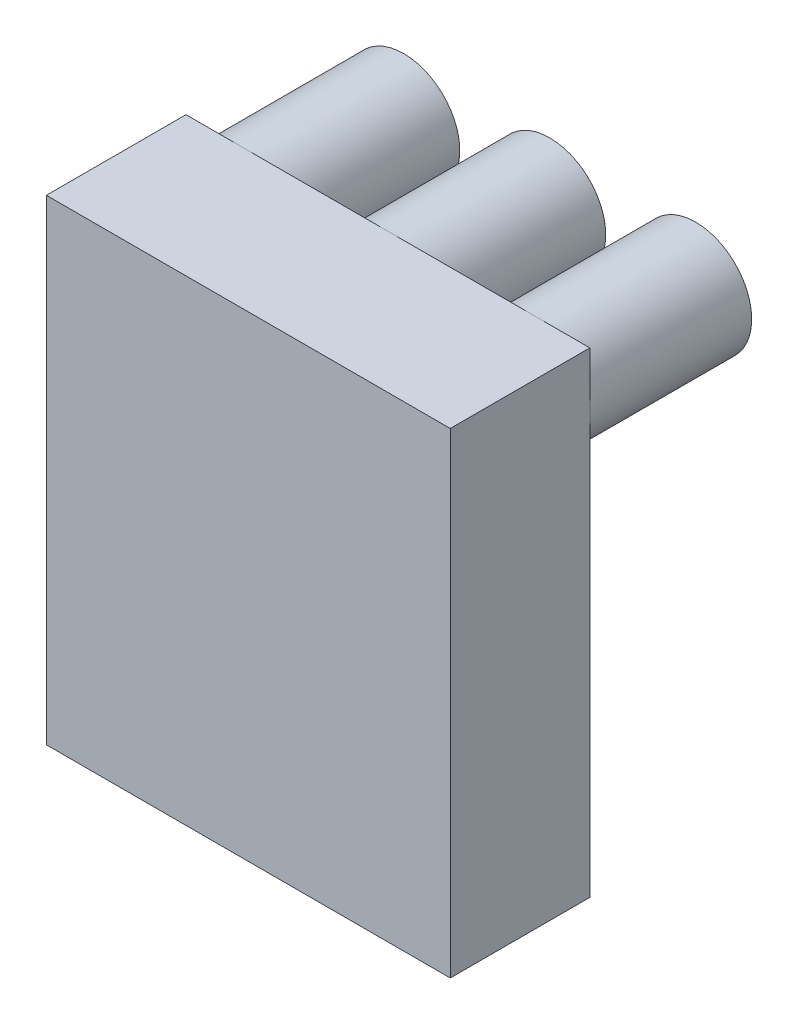
ISO-10303-21;
HEADER;
FILE_DESCRIPTION(('STEP AP214'),'2;1');
FILE_NAME('part.step','',(''),(''),'','','');
FILE_SCHEMA(('AUTOMOTIVE_DESIGN { 1 0 10303 214 1 1 1 1 }'));
ENDSEC;
DATA;
#1=APPLICATION_CONTEXT('core data for automotive mechanical design processes');
#2=APPLICATION_PROTOCOL_DEFINITION('international standard','automotive_design',2000,#1);
#3=PRODUCT_CONTEXT('',#1,'mechanical');
#4=PRODUCT('Part','Part','',(#3));
#5=PRODUCT_RELATED_PRODUCT_CATEGORY('part','',(#4));
#6=PRODUCT_DEFINITION_FORMATION('','',#4);
#7=PRODUCT_DEFINITION_CONTEXT('part definition',#1,'design');
#8=PRODUCT_DEFINITION('design','',#6,#7);
#9=PRODUCT_DEFINITION_SHAPE('','',#8);
#10=(LENGTH_UNIT() NAMED_UNIT(*) SI_UNIT(.MILLI.,.METRE.));
#11=(NAMED_UNIT(*) PLANE_ANGLE_UNIT() SI_UNIT($,.RADIAN.));
#12=(NAMED_UNIT(*) SI_UNIT($,.STERADIAN.) SOLID_ANGLE_UNIT());
#13=UNCERTAINTY_MEASURE_WITH_UNIT(LENGTH_MEASURE(1.E-05),#10,'distance_accuracy_value','');
#14=(GEOMETRIC_REPRESENTATION_CONTEXT(3) GLOBAL_UNCERTAINTY_ASSIGNED_CONTEXT((#13)) GLOBAL_UNIT_ASSIGNED_CONTEXT((#10,
#11,#12)) REPRESENTATION_CONTEXT('',''));
#15=CARTESIAN_POINT('',(0.,0.,0.));
#16=DIRECTION('',(0.,0.,1.));
#17=DIRECTION('',(1.,0.,0.));
#18=AXIS2_PLACEMENT_3D('',#15,#16,#17);
#19=CARTESIAN_POINT('',(40.41775,-84.04225,32.385));
#20=DIRECTION('',(0.,0.,-1.));
#21=DIRECTION('',(-1.,0.,0.));
#22=AXIS2_PLACEMENT_3D('',#19,#20,#21);
#23=PLANE('',#22);
#24=DIRECTION('',(-1.,0.,0.));
#25=VECTOR('',#24,1.);
#26=CARTESIAN_POINT('',(40.41775,11.20775,32.385));
#27=LINE('',#26,#25);
#28=CARTESIAN_POINT('',(-29.21,11.20775,32.385));
#29=VERTEX_POINT('',#28);
#30=CARTESIAN_POINT('',(-40.41775,11.20775,32.385));
#31=VERTEX_POINT('',#30);
#32=EDGE_CURVE('E239',#29,#31,#27,.T.);
#33=ORIENTED_EDGE('',*,*,#32,.F.);
#34=CARTESIAN_POINT('',(-29.21,0.,32.385));
#35=DIRECTION('',(0.,0.,-1.));
#36=DIRECTION('',(-1.,0.,0.));
#37=AXIS2_PLACEMENT_3D('',#34,#35,#36);
#38=CIRCLE('',#37,11.20775);
#39=CARTESIAN_POINT('',(-40.41775,0.,32.385));
#40=VERTEX_POINT('',#39);
#41=EDGE_CURVE('E199',#29,#40,#38,.F.);
#42=ORIENTED_EDGE('',*,*,#41,.T.);
#43=DIRECTION('',(0.,1.,0.));
#44=VECTOR('',#43,1.);
#45=CARTESIAN_POINT('',(-40.41775,-84.04225,32.385));
#46=LINE('',#45,#44);
#47=EDGE_CURVE('E272',#40,#31,#46,.T.);
#48=ORIENTED_EDGE('',*,*,#47,.T.);
#49=EDGE_LOOP('',(#33,#42,#48));
#50=FACE_BOUND('',#49,.T.);
#51=ADVANCED_FACE('F33',(#50),#23,.T.);
#52=DIRECTION('',(0.,1.,0.));
#53=VECTOR('',#52,1.);
#54=CARTESIAN_POINT('',(-27.4955,-84.04225,32.385));
#55=LINE('',#54,#53);
#56=CARTESIAN_POINT('',(-27.4955,-12.1045363030744,32.385));
#57=VERTEX_POINT('',#56);
#58=CARTESIAN_POINT('',(-27.4955,-11.0758363030744,32.385));
#59=VERTEX_POINT('',#58);
#60=EDGE_CURVE('E172',#57,#59,#55,.T.);
#61=ORIENTED_EDGE('',*,*,#60,.T.);
#62=EDGE_CURVE('E202',#59,#29,#38,.F.);
#63=ORIENTED_EDGE('',*,*,#62,.T.);
#64=CARTESIAN_POINT('',(0.,11.20775,32.385));
#65=VERTEX_POINT('',#64);
#66=EDGE_CURVE('E245',#65,#29,#27,.T.);
#67=ORIENTED_EDGE('',*,*,#66,.F.);
#68=CARTESIAN_POINT('',(0.,0.,32.385));
#69=DIRECTION('',(0.,0.,-1.));
#70=DIRECTION('',(-1.,0.,0.));
#71=AXIS2_PLACEMENT_3D('',#68,#69,#70);
#72=CIRCLE('',#71,11.20775);
#73=CARTESIAN_POINT('',(-1.7145,-11.0758363030744,32.385));
#74=VERTEX_POINT('',#73);
#75=EDGE_CURVE('E281',#74,#65,#72,.T.);
#76=ORIENTED_EDGE('',*,*,#75,.F.);
#77=DIRECTION('',(0.,1.,0.));
#78=VECTOR('',#77,1.);
#79=CARTESIAN_POINT('',(-1.71449999999999,0.,32.385));
#80=LINE('',#79,#78);
#81=CARTESIAN_POINT('',(-1.7145,-12.1045363030744,32.385));
#82=VERTEX_POINT('',#81);
#83=EDGE_CURVE('E278',#82,#74,#80,.T.);
#84=ORIENTED_EDGE('',*,*,#83,.F.);
#85=DIRECTION('',(-1.,0.,0.));
#86=VECTOR('',#85,1.);
#87=CARTESIAN_POINT('',(0.,-12.1045363030744,32.385));
#88=LINE('',#87,#86);
#89=CARTESIAN_POINT('',(1.7145,-12.1045363030744,32.385));
#90=VERTEX_POINT('',#89);
#91=EDGE_CURVE('E266',#90,#82,#88,.T.);
#92=ORIENTED_EDGE('',*,*,#91,.F.);
#93=DIRECTION('',(0.,-1.,0.));
#94=VECTOR('',#93,1.);
#95=CARTESIAN_POINT('',(1.71449999999999,0.,32.385));
#96=LINE('',#95,#94);
#97=CARTESIAN_POINT('',(1.7145,-11.0758363030744,32.385));
#98=VERTEX_POINT('',#97);
#99=EDGE_CURVE('E11',#98,#90,#96,.T.);
#100=ORIENTED_EDGE('',*,*,#99,.F.);
#101=EDGE_CURVE('E284',#65,#98,#72,.T.);
#102=ORIENTED_EDGE('',*,*,#101,.F.);
#103=CARTESIAN_POINT('',(29.21,11.20775,32.385));
#104=VERTEX_POINT('',#103);
#105=EDGE_CURVE('E244',#104,#65,#27,.T.);
#106=ORIENTED_EDGE('',*,*,#105,.F.);
#107=CARTESIAN_POINT('',(29.21,0.,32.385));
#108=DIRECTION('',(0.,0.,-1.));
#109=DIRECTION('',(-1.,0.,0.));
#110=AXIS2_PLACEMENT_3D('',#107,#108,#109);
#111=CIRCLE('',#110,11.20775);
#112=CARTESIAN_POINT('',(27.4955,-11.0758363030744,32.385));
#113=VERTEX_POINT('',#112);
#114=EDGE_CURVE('E234',#104,#113,#111,.F.);
#115=ORIENTED_EDGE('',*,*,#114,.T.);
#116=DIRECTION('',(0.,-1.,0.));
#117=VECTOR('',#116,1.);
#118=CARTESIAN_POINT('',(27.4955,-84.04225,32.385));
#119=LINE('',#118,#117);
#120=CARTESIAN_POINT('',(27.4955,-12.1045363030744,32.385));
#121=VERTEX_POINT('',#120);
#122=EDGE_CURVE('E228',#113,#121,#119,.T.);
#123=ORIENTED_EDGE('',*,*,#122,.T.);
#124=DIRECTION('',(1.,0.,0.));
#125=VECTOR('',#124,1.);
#126=CARTESIAN_POINT('',(40.41775,-12.1045363030744,32.385));
#127=LINE('',#126,#125);
#128=CARTESIAN_POINT('',(30.9245,-12.1045363030744,32.385));
#129=VERTEX_POINT('',#128);
#130=EDGE_CURVE('E225',#121,#129,#127,.T.);
#131=ORIENTED_EDGE('',*,*,#130,.T.);
#132=DIRECTION('',(0.,1.,0.));
#133=VECTOR('',#132,1.);
#134=CARTESIAN_POINT('',(30.9245,-84.04225,32.385));
#135=LINE('',#134,#133);
#136=CARTESIAN_POINT('',(30.9245,-11.0758363030744,32.385));
#137=VERTEX_POINT('',#136);
#138=EDGE_CURVE('E222',#129,#137,#135,.T.);
#139=ORIENTED_EDGE('',*,*,#138,.T.);
#140=CARTESIAN_POINT('',(40.41775,0.,32.385));
#141=VERTEX_POINT('',#140);
#142=EDGE_CURVE('E231',#137,#141,#111,.F.);
#143=ORIENTED_EDGE('',*,*,#142,.T.);
#144=DIRECTION('',(0.,1.,0.));
#145=VECTOR('',#144,1.);
#146=CARTESIAN_POINT('',(40.41775,-84.04225,32.385));
#147=LINE('',#146,#145);
#148=CARTESIAN_POINT('',(40.41775,-84.04225,32.385));
#149=VERTEX_POINT('',#148);
#150=EDGE_CURVE('E273',#149,#141,#147,.T.);
#151=ORIENTED_EDGE('',*,*,#150,.F.);
#152=DIRECTION('',(-1.,0.,0.));
#153=VECTOR('',#152,1.);
#154=CARTESIAN_POINT('',(40.41775,-84.04225,32.385));
#155=LINE('',#154,#153);
#156=CARTESIAN_POINT('',(-40.41775,-84.04225,32.385));
#157=VERTEX_POINT('',#156);
#158=EDGE_CURVE('E253',#149,#157,#155,.T.);
#159=ORIENTED_EDGE('',*,*,#158,.T.);
#160=EDGE_CURVE('E269',#157,#40,#46,.T.);
#161=ORIENTED_EDGE('',*,*,#160,.T.);
#162=CARTESIAN_POINT('',(-30.9245,-11.0758363030744,32.385));
#163=VERTEX_POINT('',#162);
#164=EDGE_CURVE('E203',#40,#163,#38,.F.);
#165=ORIENTED_EDGE('',*,*,#164,.T.);
#166=DIRECTION('',(0.,-1.,0.));
#167=VECTOR('',#166,1.);
#168=CARTESIAN_POINT('',(-30.9245,-84.04225,32.385));
#169=LINE('',#168,#167);
#170=CARTESIAN_POINT('',(-30.9245,-12.1045363030744,32.385));
#171=VERTEX_POINT('',#170);
#172=EDGE_CURVE('E168',#163,#171,#169,.T.);
#173=ORIENTED_EDGE('',*,*,#172,.T.);
#174=DIRECTION('',(1.,0.,0.));
#175=VECTOR('',#174,1.);
#176=CARTESIAN_POINT('',(40.41775,-12.1045363030744,32.385));
#177=LINE('',#176,#175);
#178=EDGE_CURVE('E195',#171,#57,#177,.T.);
#179=ORIENTED_EDGE('',*,*,#178,.T.);
#180=EDGE_LOOP('',(#61,#63,#67,#76,#84,#92,#100,#102,#106,#115,#123,#131,#139,#143,#151,#159,
#161,#165,#173,#179));
#181=FACE_BOUND('',#180,.T.);
#182=ADVANCED_FACE('F322',(#181),#23,.T.);
#183=CARTESIAN_POINT('',(40.41775,11.20775,32.385));
#184=VERTEX_POINT('',#183);
#185=EDGE_CURVE('E262',#141,#184,#147,.T.);
#186=ORIENTED_EDGE('',*,*,#185,.F.);
#187=EDGE_CURVE('E235',#141,#104,#111,.F.);
#188=ORIENTED_EDGE('',*,*,#187,.T.);
#189=EDGE_CURVE('E240',#184,#104,#27,.T.);
#190=ORIENTED_EDGE('',*,*,#189,.F.);
#191=EDGE_LOOP('',(#186,#188,#190));
#192=FACE_BOUND('',#191,.T.);
#193=ADVANCED_FACE('F348',(#192),#23,.T.);
#194=CARTESIAN_POINT('',(0.,0.,60.325));
#195=DIRECTION('',(0.,0.,-1.));
#196=DIRECTION('',(-1.,0.,0.));
#197=AXIS2_PLACEMENT_3D('',#194,#195,#196);
#198=CYLINDRICAL_SURFACE('',#197,11.20775);
#199=ORIENTED_EDGE('',*,*,#75,.T.);
#200=ORIENTED_EDGE('',*,*,#101,.T.);
#201=DIRECTION('',(0.,0.,-1.));
#202=VECTOR('',#201,1.);
#203=CARTESIAN_POINT('',(1.7145,-11.0758363030744,60.325));
#204=LINE('',#203,#202);
#205=CARTESIAN_POINT('',(1.7145,-11.0758363030744,0.));
#206=VERTEX_POINT('',#205);
#207=EDGE_CURVE('E297',#98,#206,#204,.T.);
#208=ORIENTED_EDGE('',*,*,#207,.T.);
#209=CARTESIAN_POINT('',(0.,0.,0.));
#210=DIRECTION('',(0.,0.,1.));
#211=DIRECTION('',(1.,0.,0.));
#212=AXIS2_PLACEMENT_3D('',#209,#210,#211);
#213=CIRCLE('',#212,11.20775);
#214=CARTESIAN_POINT('',(-1.7145,-11.0758363030744,0.));
#215=VERTEX_POINT('',#214);
#216=EDGE_CURVE('E285',#206,#215,#213,.T.);
#217=ORIENTED_EDGE('',*,*,#216,.T.);
#218=DIRECTION('',(0.,0.,-1.));
#219=VECTOR('',#218,1.);
#220=CARTESIAN_POINT('',(-1.7145,-11.0758363030744,60.325));
#221=LINE('',#220,#219);
#222=EDGE_CURVE('E41',#74,#215,#221,.T.);
#223=ORIENTED_EDGE('',*,*,#222,.F.);
#224=EDGE_LOOP('',(#199,#200,#208,#217,#223));
#225=FACE_BOUND('',#224,.T.);
#226=ADVANCED_FACE('F35',(#225),#198,.T.);
#227=CARTESIAN_POINT('',(-1.71449999999999,0.,60.325));
#228=DIRECTION('',(1.,0.,0.));
#229=DIRECTION('',(0.,1.,0.));
#230=AXIS2_PLACEMENT_3D('',#227,#228,#229);
#231=PLANE('',#230);
#232=DIRECTION('',(0.,0.,-1.));
#233=VECTOR('',#232,1.);
#234=CARTESIAN_POINT('',(-1.7145,-12.1045363030744,60.325));
#235=LINE('',#234,#233);
#236=CARTESIAN_POINT('',(-1.7145,-12.1045363030744,0.));
#237=VERTEX_POINT('',#236);
#238=EDGE_CURVE('E301',#82,#237,#235,.T.);
#239=ORIENTED_EDGE('',*,*,#238,.F.);
#240=ORIENTED_EDGE('',*,*,#83,.T.);
#241=ORIENTED_EDGE('',*,*,#222,.T.);
#242=DIRECTION('',(0.,-1.,0.));
#243=VECTOR('',#242,1.);
#244=CARTESIAN_POINT('',(-1.71449999999999,0.,0.));
#245=LINE('',#244,#243);
#246=EDGE_CURVE('E288',#215,#237,#245,.T.);
#247=ORIENTED_EDGE('',*,*,#246,.T.);
#248=EDGE_LOOP('',(#239,#240,#241,#247));
#249=FACE_BOUND('',#248,.T.);
#250=ADVANCED_FACE('F306',(#249),#231,.F.);
#251=CARTESIAN_POINT('',(0.,-12.1045363030744,60.325));
#252=DIRECTION('',(0.,1.,0.));
#253=DIRECTION('',(0.,0.,1.));
#254=AXIS2_PLACEMENT_3D('',#251,#252,#253);
#255=PLANE('',#254);
#256=DIRECTION('',(0.,0.,-1.));
#257=VECTOR('',#256,1.);
#258=CARTESIAN_POINT('',(1.7145,-12.1045363030744,60.325));
#259=LINE('',#258,#257);
#260=CARTESIAN_POINT('',(1.7145,-12.1045363030744,0.));
#261=VERTEX_POINT('',#260);
#262=EDGE_CURVE('E299',#90,#261,#259,.T.);
#263=ORIENTED_EDGE('',*,*,#262,.F.);
#264=ORIENTED_EDGE('',*,*,#91,.T.);
#265=ORIENTED_EDGE('',*,*,#238,.T.);
#266=DIRECTION('',(1.,0.,0.));
#267=VECTOR('',#266,1.);
#268=CARTESIAN_POINT('',(0.,-12.1045363030744,0.));
#269=LINE('',#268,#267);
#270=EDGE_CURVE('E291',#237,#261,#269,.T.);
#271=ORIENTED_EDGE('',*,*,#270,.T.);
#272=EDGE_LOOP('',(#263,#264,#265,#271));
#273=FACE_BOUND('',#272,.T.);
#274=ADVANCED_FACE('F320',(#273),#255,.F.);
#275=CARTESIAN_POINT('',(1.71449999999999,0.,60.325));
#276=DIRECTION('',(-1.,0.,0.));
#277=DIRECTION('',(0.,-1.,0.));
#278=AXIS2_PLACEMENT_3D('',#275,#276,#277);
#279=PLANE('',#278);
#280=ORIENTED_EDGE('',*,*,#207,.F.);
#281=ORIENTED_EDGE('',*,*,#99,.T.);
#282=ORIENTED_EDGE('',*,*,#262,.T.);
#283=DIRECTION('',(0.,1.,0.));
#284=VECTOR('',#283,1.);
#285=CARTESIAN_POINT('',(1.71449999999999,0.,0.));
#286=LINE('',#285,#284);
#287=EDGE_CURVE('E294',#261,#206,#286,.T.);
#288=ORIENTED_EDGE('',*,*,#287,.T.);
#289=EDGE_LOOP('',(#280,#281,#282,#288));
#290=FACE_BOUND('',#289,.T.);
#291=ADVANCED_FACE('F317',(#290),#279,.F.);
#292=CARTESIAN_POINT('',(0.,0.,0.));
#293=DIRECTION('',(0.,0.,1.));
#294=DIRECTION('',(1.,0.,0.));
#295=AXIS2_PLACEMENT_3D('',#292,#293,#294);
#296=PLANE('',#295);
#297=ORIENTED_EDGE('',*,*,#216,.F.);
#298=ORIENTED_EDGE('',*,*,#287,.F.);
#299=ORIENTED_EDGE('',*,*,#270,.F.);
#300=ORIENTED_EDGE('',*,*,#246,.F.);
#301=EDGE_LOOP('',(#297,#298,#299,#300));
#302=FACE_BOUND('',#301,.T.);
#303=ADVANCED_FACE('F311',(#302),#296,.F.);
#304=CARTESIAN_POINT('',(0.,11.20775,0.));
#305=DIRECTION('',(0.,1.,0.));
#306=DIRECTION('',(0.,0.,1.));
#307=AXIS2_PLACEMENT_3D('',#304,#305,#306);
#308=PLANE('',#307);
#309=DIRECTION('',(1.,0.,0.));
#310=VECTOR('',#309,1.);
#311=CARTESIAN_POINT('',(40.41775,11.20775,60.325));
#312=LINE('',#311,#310);
#313=CARTESIAN_POINT('',(-40.41775,11.20775,60.325));
#314=VERTEX_POINT('',#313);
#315=CARTESIAN_POINT('',(40.41775,11.20775,60.325));
#316=VERTEX_POINT('',#315);
#317=EDGE_CURVE('E248',#314,#316,#312,.T.);
#318=ORIENTED_EDGE('',*,*,#317,.T.);
#319=DIRECTION('',(0.,0.,-1.));
#320=VECTOR('',#319,1.);
#321=CARTESIAN_POINT('',(40.41775,11.20775,60.325));
#322=LINE('',#321,#320);
#323=EDGE_CURVE('E236',#316,#184,#322,.T.);
#324=ORIENTED_EDGE('',*,*,#323,.T.);
#325=ORIENTED_EDGE('',*,*,#189,.T.);
#326=ORIENTED_EDGE('',*,*,#105,.T.);
#327=ORIENTED_EDGE('',*,*,#66,.T.);
#328=ORIENTED_EDGE('',*,*,#32,.T.);
#329=DIRECTION('',(0.,0.,1.));
#330=VECTOR('',#329,1.);
#331=CARTESIAN_POINT('',(-40.41775,11.20775,60.325));
#332=LINE('',#331,#330);
#333=EDGE_CURVE('E243',#31,#314,#332,.T.);
#334=ORIENTED_EDGE('',*,*,#333,.T.);
#335=EDGE_LOOP('',(#318,#324,#325,#326,#327,#328,#334));
#336=FACE_BOUND('',#335,.T.);
#337=ADVANCED_FACE('F329',(#336),#308,.T.);
#338=CARTESIAN_POINT('',(40.41775,-84.04225,60.325));
#339=DIRECTION('',(1.,0.,0.));
#340=DIRECTION('',(0.,0.,-1.));
#341=AXIS2_PLACEMENT_3D('',#338,#339,#340);
#342=PLANE('',#341);
#343=ORIENTED_EDGE('',*,*,#323,.F.);
#344=DIRECTION('',(0.,1.,0.));
#345=VECTOR('',#344,1.);
#346=CARTESIAN_POINT('',(40.41775,-84.04225,60.325));
#347=LINE('',#346,#345);
#348=CARTESIAN_POINT('',(40.41775,-84.04225,60.325));
#349=VERTEX_POINT('',#348);
#350=EDGE_CURVE('E263',#349,#316,#347,.T.);
#351=ORIENTED_EDGE('',*,*,#350,.F.);
#352=DIRECTION('',(0.,0.,-1.));
#353=VECTOR('',#352,1.);
#354=CARTESIAN_POINT('',(40.41775,-84.04225,60.325));
#355=LINE('',#354,#353);
#356=EDGE_CURVE('E250',#349,#149,#355,.T.);
#357=ORIENTED_EDGE('',*,*,#356,.T.);
#358=ORIENTED_EDGE('',*,*,#150,.T.);
#359=ORIENTED_EDGE('',*,*,#185,.T.);
#360=EDGE_LOOP('',(#343,#351,#357,#358,#359));
#361=FACE_BOUND('',#360,.T.);
#362=ADVANCED_FACE('F343',(#361),#342,.T.);
#363=CARTESIAN_POINT('',(-40.41775,-84.04225,60.325));
#364=DIRECTION('',(-1.,0.,0.));
#365=DIRECTION('',(0.,0.,1.));
#366=AXIS2_PLACEMENT_3D('',#363,#364,#365);
#367=PLANE('',#366);
#368=DIRECTION('',(0.,1.,0.));
#369=VECTOR('',#368,1.);
#370=CARTESIAN_POINT('',(-40.41775,-84.04225,60.325));
#371=LINE('',#370,#369);
#372=CARTESIAN_POINT('',(-40.41775,-84.04225,60.325));
#373=VERTEX_POINT('',#372);
#374=EDGE_CURVE('E267',#373,#314,#371,.T.);
#375=ORIENTED_EDGE('',*,*,#374,.T.);
#376=ORIENTED_EDGE('',*,*,#333,.F.);
#377=ORIENTED_EDGE('',*,*,#47,.F.);
#378=ORIENTED_EDGE('',*,*,#160,.F.);
#379=DIRECTION('',(0.,0.,1.));
#380=VECTOR('',#379,1.);
#381=CARTESIAN_POINT('',(-40.41775,-84.04225,60.325));
#382=LINE('',#381,#380);
#383=EDGE_CURVE('E256',#157,#373,#382,.T.);
#384=ORIENTED_EDGE('',*,*,#383,.T.);
#385=EDGE_LOOP('',(#375,#376,#377,#378,#384));
#386=FACE_BOUND('',#385,.T.);
#387=ADVANCED_FACE('F334',(#386),#367,.T.);
#388=CARTESIAN_POINT('',(0.,-84.04225,0.));
#389=DIRECTION('',(0.,1.,0.));
#390=DIRECTION('',(0.,0.,1.));
#391=AXIS2_PLACEMENT_3D('',#388,#389,#390);
#392=PLANE('',#391);
#393=ORIENTED_EDGE('',*,*,#356,.F.);
#394=DIRECTION('',(1.,0.,0.));
#395=VECTOR('',#394,1.);
#396=CARTESIAN_POINT('',(40.41775,-84.04225,60.325));
#397=LINE('',#396,#395);
#398=EDGE_CURVE('E259',#373,#349,#397,.T.);
#399=ORIENTED_EDGE('',*,*,#398,.F.);
#400=ORIENTED_EDGE('',*,*,#383,.F.);
#401=ORIENTED_EDGE('',*,*,#158,.F.);
#402=EDGE_LOOP('',(#393,#399,#400,#401));
#403=FACE_BOUND('',#402,.T.);
#404=ADVANCED_FACE('F399',(#403),#392,.F.);
#405=CARTESIAN_POINT('',(0.,0.,60.325));
#406=DIRECTION('',(0.,0.,1.));
#407=DIRECTION('',(1.,0.,0.));
#408=AXIS2_PLACEMENT_3D('',#405,#406,#407);
#409=PLANE('',#408);
#410=ORIENTED_EDGE('',*,*,#350,.T.);
#411=ORIENTED_EDGE('',*,*,#317,.F.);
#412=ORIENTED_EDGE('',*,*,#374,.F.);
#413=ORIENTED_EDGE('',*,*,#398,.T.);
#414=EDGE_LOOP('',(#410,#411,#412,#413));
#415=FACE_BOUND('',#414,.T.);
#416=ADVANCED_FACE('F339',(#415),#409,.T.);
#417=CARTESIAN_POINT('',(29.21,0.,60.325));
#418=DIRECTION('',(0.,0.,-1.));
#419=DIRECTION('',(-1.,0.,0.));
#420=AXIS2_PLACEMENT_3D('',#417,#418,#419);
#421=CYLINDRICAL_SURFACE('',#420,11.20775);
#422=ORIENTED_EDGE('',*,*,#187,.F.);
#423=ORIENTED_EDGE('',*,*,#142,.F.);
#424=DIRECTION('',(0.,0.,-1.));
#425=VECTOR('',#424,1.);
#426=CARTESIAN_POINT('',(30.9245,-11.0758363030744,60.325));
#427=LINE('',#426,#425);
#428=CARTESIAN_POINT('',(30.9245,-11.0758363030744,0.));
#429=VERTEX_POINT('',#428);
#430=EDGE_CURVE('E56',#137,#429,#427,.T.);
#431=ORIENTED_EDGE('',*,*,#430,.T.);
#432=CARTESIAN_POINT('',(29.21,0.,0.));
#433=DIRECTION('',(0.,0.,1.));
#434=DIRECTION('',(1.,0.,0.));
#435=AXIS2_PLACEMENT_3D('',#432,#433,#434);
#436=CIRCLE('',#435,11.20775);
#437=CARTESIAN_POINT('',(27.4955,-11.0758363030744,0.));
#438=VERTEX_POINT('',#437);
#439=EDGE_CURVE('E204',#429,#438,#436,.T.);
#440=ORIENTED_EDGE('',*,*,#439,.T.);
#441=DIRECTION('',(0.,0.,-1.));
#442=VECTOR('',#441,1.);
#443=CARTESIAN_POINT('',(27.4955,-11.0758363030744,60.325));
#444=LINE('',#443,#442);
#445=EDGE_CURVE('E220',#113,#438,#444,.T.);
#446=ORIENTED_EDGE('',*,*,#445,.F.);
#447=ORIENTED_EDGE('',*,*,#114,.F.);
#448=EDGE_LOOP('',(#422,#423,#431,#440,#446,#447));
#449=FACE_BOUND('',#448,.T.);
#450=ADVANCED_FACE('F353',(#449),#421,.T.);
#451=CARTESIAN_POINT('',(27.4955,0.,60.325));
#452=DIRECTION('',(1.,0.,0.));
#453=DIRECTION('',(0.,1.,0.));
#454=AXIS2_PLACEMENT_3D('',#451,#452,#453);
#455=PLANE('',#454);
#456=ORIENTED_EDGE('',*,*,#122,.F.);
#457=ORIENTED_EDGE('',*,*,#445,.T.);
#458=DIRECTION('',(0.,-1.,0.));
#459=VECTOR('',#458,1.);
#460=CARTESIAN_POINT('',(27.4955,0.,0.));
#461=LINE('',#460,#459);
#462=CARTESIAN_POINT('',(27.4955,-12.1045363030744,0.));
#463=VERTEX_POINT('',#462);
#464=EDGE_CURVE('E207',#438,#463,#461,.T.);
#465=ORIENTED_EDGE('',*,*,#464,.T.);
#466=DIRECTION('',(0.,0.,-1.));
#467=VECTOR('',#466,1.);
#468=CARTESIAN_POINT('',(27.4955,-12.1045363030744,60.325));
#469=LINE('',#468,#467);
#470=EDGE_CURVE('E218',#121,#463,#469,.T.);
#471=ORIENTED_EDGE('',*,*,#470,.F.);
#472=EDGE_LOOP('',(#456,#457,#465,#471));
#473=FACE_BOUND('',#472,.T.);
#474=ADVANCED_FACE('F357',(#473),#455,.F.);
#475=CARTESIAN_POINT('',(29.21,-12.1045363030744,60.325));
#476=DIRECTION('',(0.,1.,0.));
#477=DIRECTION('',(0.,0.,1.));
#478=AXIS2_PLACEMENT_3D('',#475,#476,#477);
#479=PLANE('',#478);
#480=ORIENTED_EDGE('',*,*,#130,.F.);
#481=ORIENTED_EDGE('',*,*,#470,.T.);
#482=DIRECTION('',(1.,0.,0.));
#483=VECTOR('',#482,1.);
#484=CARTESIAN_POINT('',(29.21,-12.1045363030744,0.));
#485=LINE('',#484,#483);
#486=CARTESIAN_POINT('',(30.9245,-12.1045363030744,0.));
#487=VERTEX_POINT('',#486);
#488=EDGE_CURVE('E210',#463,#487,#485,.T.);
#489=ORIENTED_EDGE('',*,*,#488,.T.);
#490=DIRECTION('',(0.,0.,-1.));
#491=VECTOR('',#490,1.);
#492=CARTESIAN_POINT('',(30.9245,-12.1045363030744,60.325));
#493=LINE('',#492,#491);
#494=EDGE_CURVE('E216',#129,#487,#493,.T.);
#495=ORIENTED_EDGE('',*,*,#494,.F.);
#496=EDGE_LOOP('',(#480,#481,#489,#495));
#497=FACE_BOUND('',#496,.T.);
#498=ADVANCED_FACE('F365',(#497),#479,.F.);
#499=CARTESIAN_POINT('',(30.9245,0.,60.325));
#500=DIRECTION('',(-1.,0.,0.));
#501=DIRECTION('',(0.,-1.,0.));
#502=AXIS2_PLACEMENT_3D('',#499,#500,#501);
#503=PLANE('',#502);
#504=ORIENTED_EDGE('',*,*,#138,.F.);
#505=ORIENTED_EDGE('',*,*,#494,.T.);
#506=DIRECTION('',(0.,1.,0.));
#507=VECTOR('',#506,1.);
#508=CARTESIAN_POINT('',(30.9245,0.,0.));
#509=LINE('',#508,#507);
#510=EDGE_CURVE('E213',#487,#429,#509,.T.);
#511=ORIENTED_EDGE('',*,*,#510,.T.);
#512=ORIENTED_EDGE('',*,*,#430,.F.);
#513=EDGE_LOOP('',(#504,#505,#511,#512));
#514=FACE_BOUND('',#513,.T.);
#515=ADVANCED_FACE('F366',(#514),#503,.F.);
#516=CARTESIAN_POINT('',(29.21,0.,0.));
#517=DIRECTION('',(0.,0.,1.));
#518=DIRECTION('',(1.,0.,0.));
#519=AXIS2_PLACEMENT_3D('',#516,#517,#518);
#520=PLANE('',#519);
#521=ORIENTED_EDGE('',*,*,#439,.F.);
#522=ORIENTED_EDGE('',*,*,#510,.F.);
#523=ORIENTED_EDGE('',*,*,#488,.F.);
#524=ORIENTED_EDGE('',*,*,#464,.F.);
#525=EDGE_LOOP('',(#521,#522,#523,#524));
#526=FACE_BOUND('',#525,.T.);
#527=ADVANCED_FACE('F361',(#526),#520,.F.);
#528=CARTESIAN_POINT('',(-29.21,0.,60.325));
#529=DIRECTION('',(0.,0.,-1.));
#530=DIRECTION('',(-1.,0.,0.));
#531=AXIS2_PLACEMENT_3D('',#528,#529,#530);
#532=CYLINDRICAL_SURFACE('',#531,11.20775);
#533=ORIENTED_EDGE('',*,*,#164,.F.);
#534=ORIENTED_EDGE('',*,*,#41,.F.);
#535=ORIENTED_EDGE('',*,*,#62,.F.);
#536=DIRECTION('',(0.,0.,-1.));
#537=VECTOR('',#536,1.);
#538=CARTESIAN_POINT('',(-27.4955,-11.0758363030744,60.325));
#539=LINE('',#538,#537);
#540=CARTESIAN_POINT('',(-27.4955,-11.0758363030744,0.));
#541=VERTEX_POINT('',#540);
#542=EDGE_CURVE('E48',#59,#541,#539,.T.);
#543=ORIENTED_EDGE('',*,*,#542,.T.);
#544=CARTESIAN_POINT('',(-29.21,0.,0.));
#545=DIRECTION('',(0.,0.,1.));
#546=DIRECTION('',(1.,0.,0.));
#547=AXIS2_PLACEMENT_3D('',#544,#545,#546);
#548=CIRCLE('',#547,11.20775);
#549=CARTESIAN_POINT('',(-30.9245,-11.0758363030744,0.));
#550=VERTEX_POINT('',#549);
#551=EDGE_CURVE('E179',#541,#550,#548,.T.);
#552=ORIENTED_EDGE('',*,*,#551,.T.);
#553=DIRECTION('',(0.,0.,-1.));
#554=VECTOR('',#553,1.);
#555=CARTESIAN_POINT('',(-30.9245,-11.0758363030744,60.325));
#556=LINE('',#555,#554);
#557=EDGE_CURVE('E161',#163,#550,#556,.T.);
#558=ORIENTED_EDGE('',*,*,#557,.F.);
#559=EDGE_LOOP('',(#533,#534,#535,#543,#552,#558));
#560=FACE_BOUND('',#559,.T.);
#561=ADVANCED_FACE('F183',(#560),#532,.T.);
#562=CARTESIAN_POINT('',(-30.9245,0.,60.325));
#563=DIRECTION('',(1.,0.,0.));
#564=DIRECTION('',(0.,1.,0.));
#565=AXIS2_PLACEMENT_3D('',#562,#563,#564);
#566=PLANE('',#565);
#567=ORIENTED_EDGE('',*,*,#172,.F.);
#568=ORIENTED_EDGE('',*,*,#557,.T.);
#569=DIRECTION('',(0.,-1.,0.));
#570=VECTOR('',#569,1.);
#571=CARTESIAN_POINT('',(-30.9245,0.,0.));
#572=LINE('',#571,#570);
#573=CARTESIAN_POINT('',(-30.9245,-12.1045363030744,0.));
#574=VERTEX_POINT('',#573);
#575=EDGE_CURVE('E165',#550,#574,#572,.T.);
#576=ORIENTED_EDGE('',*,*,#575,.T.);
#577=DIRECTION('',(0.,0.,-1.));
#578=VECTOR('',#577,1.);
#579=CARTESIAN_POINT('',(-30.9245,-12.1045363030744,60.325));
#580=LINE('',#579,#578);
#581=EDGE_CURVE('E173',#171,#574,#580,.T.);
#582=ORIENTED_EDGE('',*,*,#581,.F.);
#583=EDGE_LOOP('',(#567,#568,#576,#582));
#584=FACE_BOUND('',#583,.T.);
#585=ADVANCED_FACE('F163',(#584),#566,.F.);
#586=CARTESIAN_POINT('',(-29.21,-12.1045363030744,60.325));
#587=DIRECTION('',(0.,1.,0.));
#588=DIRECTION('',(0.,0.,1.));
#589=AXIS2_PLACEMENT_3D('',#586,#587,#588);
#590=PLANE('',#589);
#591=ORIENTED_EDGE('',*,*,#178,.F.);
#592=ORIENTED_EDGE('',*,*,#581,.T.);
#593=DIRECTION('',(1.,0.,0.));
#594=VECTOR('',#593,1.);
#595=CARTESIAN_POINT('',(-29.21,-12.1045363030744,0.));
#596=LINE('',#595,#594);
#597=CARTESIAN_POINT('',(-27.4955,-12.1045363030744,0.));
#598=VERTEX_POINT('',#597);
#599=EDGE_CURVE('E181',#574,#598,#596,.T.);
#600=ORIENTED_EDGE('',*,*,#599,.T.);
#601=DIRECTION('',(0.,0.,-1.));
#602=VECTOR('',#601,1.);
#603=CARTESIAN_POINT('',(-27.4955,-12.1045363030744,60.325));
#604=LINE('',#603,#602);
#605=EDGE_CURVE('E190',#57,#598,#604,.T.);
#606=ORIENTED_EDGE('',*,*,#605,.F.);
#607=EDGE_LOOP('',(#591,#592,#600,#606));
#608=FACE_BOUND('',#607,.T.);
#609=ADVANCED_FACE('F419',(#608),#590,.F.);
#610=CARTESIAN_POINT('',(-27.4955,0.,60.325));
#611=DIRECTION('',(-1.,0.,0.));
#612=DIRECTION('',(0.,-1.,0.));
#613=AXIS2_PLACEMENT_3D('',#610,#611,#612);
#614=PLANE('',#613);
#615=ORIENTED_EDGE('',*,*,#60,.F.);
#616=ORIENTED_EDGE('',*,*,#605,.T.);
#617=DIRECTION('',(0.,1.,0.));
#618=VECTOR('',#617,1.);
#619=CARTESIAN_POINT('',(-27.4955,0.,0.));
#620=LINE('',#619,#618);
#621=EDGE_CURVE('E187',#598,#541,#620,.T.);
#622=ORIENTED_EDGE('',*,*,#621,.T.);
#623=ORIENTED_EDGE('',*,*,#542,.F.);
#624=EDGE_LOOP('',(#615,#616,#622,#623));
#625=FACE_BOUND('',#624,.T.);
#626=ADVANCED_FACE('F417',(#625),#614,.F.);
#627=CARTESIAN_POINT('',(-29.21,0.,0.));
#628=DIRECTION('',(0.,0.,1.));
#629=DIRECTION('',(1.,0.,0.));
#630=AXIS2_PLACEMENT_3D('',#627,#628,#629);
#631=PLANE('',#630);
#632=ORIENTED_EDGE('',*,*,#551,.F.);
#633=ORIENTED_EDGE('',*,*,#621,.F.);
#634=ORIENTED_EDGE('',*,*,#599,.F.);
#635=ORIENTED_EDGE('',*,*,#575,.F.);
#636=EDGE_LOOP('',(#632,#633,#634,#635));
#637=FACE_BOUND('',#636,.T.);
#638=ADVANCED_FACE('F177',(#637),#631,.F.);
#639=CLOSED_SHELL('',(#51,#182,#193,#226,#250,#274,#291,#303,#337,#362,#387,#404,#416,#450,#474,
#498,#515,#527,#561,#585,#609,#626,#638));
#640=MANIFOLD_SOLID_BREP('B2',#639);
#641=ADVANCED_BREP_SHAPE_REPRESENTATION('',(#18,#640),#14);
#642=SHAPE_DEFINITION_REPRESENTATION(#9,#641);
ENDSEC;
END-ISO-10303-21;
